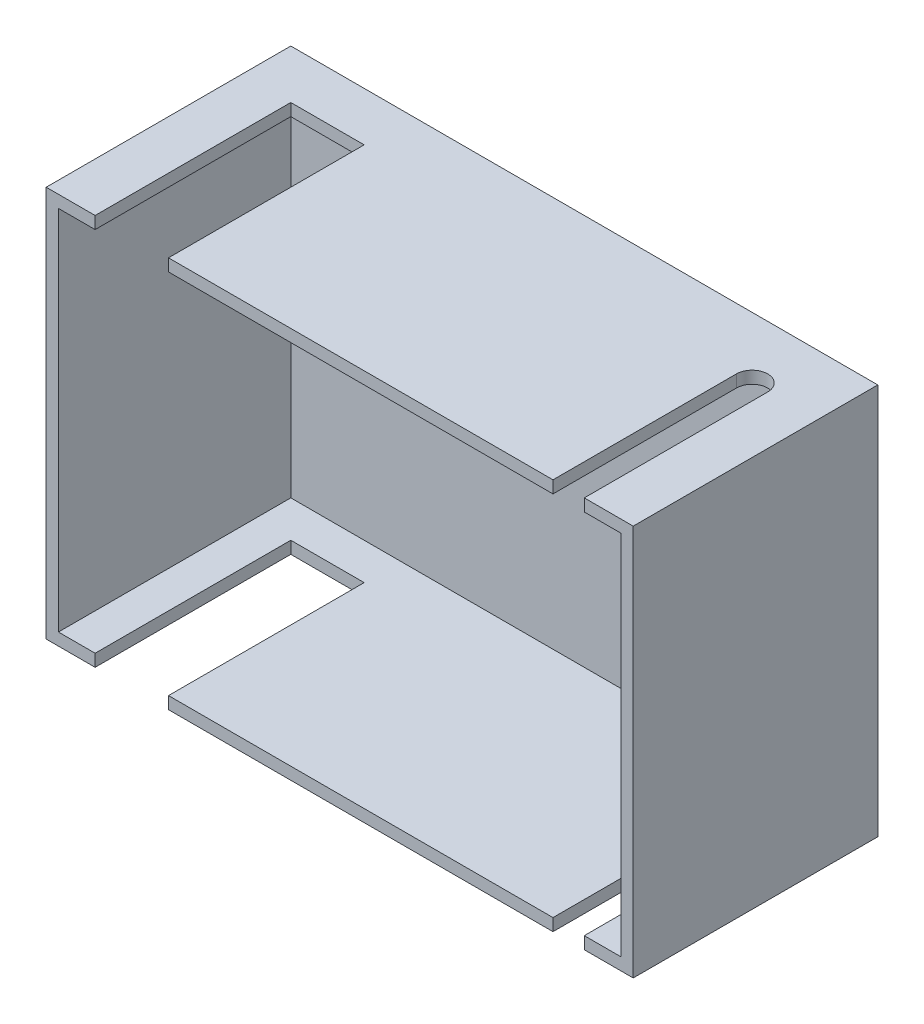
ISO-10303-21;
HEADER;
FILE_DESCRIPTION(('STEP AP214'),'2;1');
FILE_NAME('part.step','',(''),(''),'','','');
FILE_SCHEMA(('AUTOMOTIVE_DESIGN { 1 0 10303 214 1 1 1 1 }'));
ENDSEC;
DATA;
#1=APPLICATION_CONTEXT('core data for automotive mechanical design processes');
#2=APPLICATION_PROTOCOL_DEFINITION('international standard','automotive_design',2000,#1);
#3=PRODUCT_CONTEXT('',#1,'mechanical');
#4=PRODUCT('Part','Part','',(#3));
#5=PRODUCT_RELATED_PRODUCT_CATEGORY('part','',(#4));
#6=PRODUCT_DEFINITION_FORMATION('','',#4);
#7=PRODUCT_DEFINITION_CONTEXT('part definition',#1,'design');
#8=PRODUCT_DEFINITION('design','',#6,#7);
#9=PRODUCT_DEFINITION_SHAPE('','',#8);
#10=(LENGTH_UNIT() NAMED_UNIT(*) SI_UNIT(.MILLI.,.METRE.));
#11=(NAMED_UNIT(*) PLANE_ANGLE_UNIT() SI_UNIT($,.RADIAN.));
#12=(NAMED_UNIT(*) SI_UNIT($,.STERADIAN.) SOLID_ANGLE_UNIT());
#13=UNCERTAINTY_MEASURE_WITH_UNIT(LENGTH_MEASURE(1.E-05),#10,'distance_accuracy_value','');
#14=(GEOMETRIC_REPRESENTATION_CONTEXT(3) GLOBAL_UNCERTAINTY_ASSIGNED_CONTEXT((#13)) GLOBAL_UNIT_ASSIGNED_CONTEXT((#10,
#11,#12)) REPRESENTATION_CONTEXT('',''));
#15=CARTESIAN_POINT('',(0.,0.,0.));
#16=DIRECTION('',(0.,0.,1.));
#17=DIRECTION('',(1.,0.,0.));
#18=AXIS2_PLACEMENT_3D('',#15,#16,#17);
#19=CARTESIAN_POINT('',(0.,0.,50.));
#20=DIRECTION('',(0.,0.,1.));
#21=DIRECTION('',(1.,0.,0.));
#22=AXIS2_PLACEMENT_3D('',#19,#20,#21);
#23=PLANE('',#22);
#24=DIRECTION('',(1.,0.,0.));
#25=VECTOR('',#24,1.);
#26=CARTESIAN_POINT('',(-60.,-40.,50.));
#27=LINE('',#26,#25);
#28=CARTESIAN_POINT('',(-35.,-40.,50.));
#29=VERTEX_POINT('',#28);
#30=CARTESIAN_POINT('',(43.6,-40.,50.));
#31=VERTEX_POINT('',#30);
#32=EDGE_CURVE('E325',#29,#31,#27,.T.);
#33=ORIENTED_EDGE('',*,*,#32,.T.);
#34=DIRECTION('',(0.,1.,0.));
#35=VECTOR('',#34,1.);
#36=CARTESIAN_POINT('',(43.6,-230.804219030922,50.));
#37=LINE('',#36,#35);
#38=CARTESIAN_POINT('',(43.6,-37.5,50.));
#39=VERTEX_POINT('',#38);
#40=EDGE_CURVE('E222',#31,#39,#37,.T.);
#41=ORIENTED_EDGE('',*,*,#40,.T.);
#42=DIRECTION('',(1.,0.,0.));
#43=VECTOR('',#42,1.);
#44=CARTESIAN_POINT('',(-60.,-37.5,50.));
#45=LINE('',#44,#43);
#46=CARTESIAN_POINT('',(-35.,-37.5,50.));
#47=VERTEX_POINT('',#46);
#48=EDGE_CURVE('E309',#47,#39,#45,.T.);
#49=ORIENTED_EDGE('',*,*,#48,.F.);
#50=DIRECTION('',(0.,-1.,0.));
#51=VECTOR('',#50,1.);
#52=CARTESIAN_POINT('',(-35.,50.,50.));
#53=LINE('',#52,#51);
#54=EDGE_CURVE('E244',#47,#29,#53,.T.);
#55=ORIENTED_EDGE('',*,*,#54,.T.);
#56=EDGE_LOOP('',(#33,#41,#49,#55));
#57=FACE_BOUND('',#56,.T.);
#58=ADVANCED_FACE('F33',(#57),#23,.T.);
#59=DIRECTION('',(-1.,0.,0.));
#60=VECTOR('',#59,1.);
#61=CARTESIAN_POINT('',(-60.,37.5,50.));
#62=LINE('',#61,#60);
#63=CARTESIAN_POINT('',(43.6,37.5,50.));
#64=VERTEX_POINT('',#63);
#65=CARTESIAN_POINT('',(-35.,37.5,50.));
#66=VERTEX_POINT('',#65);
#67=EDGE_CURVE('E303',#64,#66,#62,.T.);
#68=ORIENTED_EDGE('',*,*,#67,.F.);
#69=CARTESIAN_POINT('',(43.6,40.,50.));
#70=VERTEX_POINT('',#69);
#71=EDGE_CURVE('E358',#64,#70,#37,.T.);
#72=ORIENTED_EDGE('',*,*,#71,.T.);
#73=DIRECTION('',(-1.,0.,0.));
#74=VECTOR('',#73,1.);
#75=CARTESIAN_POINT('',(-60.,40.,50.));
#76=LINE('',#75,#74);
#77=CARTESIAN_POINT('',(-35.,40.,50.));
#78=VERTEX_POINT('',#77);
#79=EDGE_CURVE('E319',#70,#78,#76,.T.);
#80=ORIENTED_EDGE('',*,*,#79,.T.);
#81=EDGE_CURVE('E254',#78,#66,#53,.T.);
#82=ORIENTED_EDGE('',*,*,#81,.T.);
#83=EDGE_LOOP('',(#68,#72,#80,#82));
#84=FACE_BOUND('',#83,.T.);
#85=ADVANCED_FACE('F402',(#84),#23,.T.);
#86=CARTESIAN_POINT('',(60.,40.,50.));
#87=VERTEX_POINT('',#86);
#88=CARTESIAN_POINT('',(50.,40.,50.));
#89=VERTEX_POINT('',#88);
#90=EDGE_CURVE('E315',#87,#89,#76,.T.);
#91=ORIENTED_EDGE('',*,*,#90,.T.);
#92=DIRECTION('',(0.,1.,0.));
#93=VECTOR('',#92,1.);
#94=CARTESIAN_POINT('',(50.,-230.804219030922,50.));
#95=LINE('',#94,#93);
#96=CARTESIAN_POINT('',(50.,37.5,50.));
#97=VERTEX_POINT('',#96);
#98=EDGE_CURVE('E211',#97,#89,#95,.T.);
#99=ORIENTED_EDGE('',*,*,#98,.F.);
#100=CARTESIAN_POINT('',(57.5,37.5,50.));
#101=VERTEX_POINT('',#100);
#102=EDGE_CURVE('E299',#101,#97,#62,.T.);
#103=ORIENTED_EDGE('',*,*,#102,.F.);
#104=DIRECTION('',(0.,1.,0.));
#105=VECTOR('',#104,1.);
#106=CARTESIAN_POINT('',(57.5,40.,50.));
#107=LINE('',#106,#105);
#108=CARTESIAN_POINT('',(57.5,-37.5,50.));
#109=VERTEX_POINT('',#108);
#110=EDGE_CURVE('E296',#109,#101,#107,.T.);
#111=ORIENTED_EDGE('',*,*,#110,.F.);
#112=CARTESIAN_POINT('',(50.,-37.5,50.));
#113=VERTEX_POINT('',#112);
#114=EDGE_CURVE('E306',#113,#109,#45,.T.);
#115=ORIENTED_EDGE('',*,*,#114,.F.);
#116=CARTESIAN_POINT('',(50.,-40.,50.));
#117=VERTEX_POINT('',#116);
#118=EDGE_CURVE('E56',#117,#113,#95,.T.);
#119=ORIENTED_EDGE('',*,*,#118,.F.);
#120=CARTESIAN_POINT('',(60.,-40.,50.));
#121=VERTEX_POINT('',#120);
#122=EDGE_CURVE('E216',#117,#121,#27,.T.);
#123=ORIENTED_EDGE('',*,*,#122,.T.);
#124=DIRECTION('',(0.,1.,0.));
#125=VECTOR('',#124,1.);
#126=CARTESIAN_POINT('',(60.,40.,50.));
#127=LINE('',#126,#125);
#128=EDGE_CURVE('E310',#121,#87,#127,.T.);
#129=ORIENTED_EDGE('',*,*,#128,.T.);
#130=EDGE_LOOP('',(#91,#99,#103,#111,#115,#119,#123,#129));
#131=FACE_BOUND('',#130,.T.);
#132=ADVANCED_FACE('F373',(#131),#23,.T.);
#133=CARTESIAN_POINT('',(-60.,40.,50.));
#134=DIRECTION('',(0.,-1.,0.));
#135=DIRECTION('',(0.,0.,-1.));
#136=AXIS2_PLACEMENT_3D('',#133,#134,#135);
#137=PLANE('',#136);
#138=DIRECTION('',(0.,0.,1.));
#139=VECTOR('',#138,1.);
#140=CARTESIAN_POINT('',(43.6,40.,50.));
#141=LINE('',#140,#139);
#142=CARTESIAN_POINT('',(43.6,40.,12.5));
#143=VERTEX_POINT('',#142);
#144=EDGE_CURVE('E234',#143,#70,#141,.T.);
#145=ORIENTED_EDGE('',*,*,#144,.F.);
#146=CARTESIAN_POINT('',(46.8,40.,12.5));
#147=DIRECTION('',(0.,-1.,0.));
#148=DIRECTION('',(0.,0.,-1.));
#149=AXIS2_PLACEMENT_3D('',#146,#147,#148);
#150=CIRCLE('',#149,3.2);
#151=CARTESIAN_POINT('',(50.,40.,12.5));
#152=VERTEX_POINT('',#151);
#153=EDGE_CURVE('E205',#152,#143,#150,.F.);
#154=ORIENTED_EDGE('',*,*,#153,.F.);
#155=DIRECTION('',(0.,0.,-1.));
#156=VECTOR('',#155,1.);
#157=CARTESIAN_POINT('',(50.,40.,50.));
#158=LINE('',#157,#156);
#159=EDGE_CURVE('E217',#89,#152,#158,.T.);
#160=ORIENTED_EDGE('',*,*,#159,.F.);
#161=ORIENTED_EDGE('',*,*,#90,.F.);
#162=DIRECTION('',(0.,0.,-1.));
#163=VECTOR('',#162,1.);
#164=CARTESIAN_POINT('',(60.,40.,50.));
#165=LINE('',#164,#163);
#166=CARTESIAN_POINT('',(60.,40.,0.));
#167=VERTEX_POINT('',#166);
#168=EDGE_CURVE('E341',#87,#167,#165,.T.);
#169=ORIENTED_EDGE('',*,*,#168,.T.);
#170=DIRECTION('',(-1.,0.,0.));
#171=VECTOR('',#170,1.);
#172=CARTESIAN_POINT('',(-60.,40.,0.));
#173=LINE('',#172,#171);
#174=CARTESIAN_POINT('',(-60.,40.,0.));
#175=VERTEX_POINT('',#174);
#176=EDGE_CURVE('E328',#167,#175,#173,.T.);
#177=ORIENTED_EDGE('',*,*,#176,.T.);
#178=DIRECTION('',(0.,0.,-1.));
#179=VECTOR('',#178,1.);
#180=CARTESIAN_POINT('',(-60.,40.,50.));
#181=LINE('',#180,#179);
#182=CARTESIAN_POINT('',(-60.,40.,50.));
#183=VERTEX_POINT('',#182);
#184=EDGE_CURVE('E338',#183,#175,#181,.T.);
#185=ORIENTED_EDGE('',*,*,#184,.F.);
#186=CARTESIAN_POINT('',(-50.,40.,50.));
#187=VERTEX_POINT('',#186);
#188=EDGE_CURVE('E313',#187,#183,#76,.T.);
#189=ORIENTED_EDGE('',*,*,#188,.F.);
#190=DIRECTION('',(0.,0.,-1.));
#191=VECTOR('',#190,1.);
#192=CARTESIAN_POINT('',(-50.,40.,50.));
#193=LINE('',#192,#191);
#194=CARTESIAN_POINT('',(-50.,40.,10.));
#195=VERTEX_POINT('',#194);
#196=EDGE_CURVE('E259',#187,#195,#193,.T.);
#197=ORIENTED_EDGE('',*,*,#196,.T.);
#198=DIRECTION('',(1.,0.,0.));
#199=VECTOR('',#198,1.);
#200=CARTESIAN_POINT('',(-60.,40.,10.));
#201=LINE('',#200,#199);
#202=CARTESIAN_POINT('',(-35.,40.,10.));
#203=VERTEX_POINT('',#202);
#204=EDGE_CURVE('E264',#195,#203,#201,.T.);
#205=ORIENTED_EDGE('',*,*,#204,.T.);
#206=DIRECTION('',(0.,0.,1.));
#207=VECTOR('',#206,1.);
#208=CARTESIAN_POINT('',(-35.,40.,50.));
#209=LINE('',#208,#207);
#210=EDGE_CURVE('E270',#203,#78,#209,.T.);
#211=ORIENTED_EDGE('',*,*,#210,.T.);
#212=ORIENTED_EDGE('',*,*,#79,.F.);
#213=EDGE_LOOP('',(#145,#154,#160,#161,#169,#177,#185,#189,#197,#205,#211,#212));
#214=FACE_BOUND('',#213,.T.);
#215=ADVANCED_FACE('F372',(#214),#137,.F.);
#216=CARTESIAN_POINT('',(-60.,-40.,50.));
#217=DIRECTION('',(0.,1.,0.));
#218=DIRECTION('',(0.,0.,1.));
#219=AXIS2_PLACEMENT_3D('',#216,#217,#218);
#220=PLANE('',#219);
#221=DIRECTION('',(0.,0.,-1.));
#222=VECTOR('',#221,1.);
#223=CARTESIAN_POINT('',(43.6,-40.,50.));
#224=LINE('',#223,#222);
#225=CARTESIAN_POINT('',(43.6,-40.,12.5));
#226=VERTEX_POINT('',#225);
#227=EDGE_CURVE('E232',#31,#226,#224,.T.);
#228=ORIENTED_EDGE('',*,*,#227,.F.);
#229=ORIENTED_EDGE('',*,*,#32,.F.);
#230=DIRECTION('',(0.,0.,1.));
#231=VECTOR('',#230,1.);
#232=CARTESIAN_POINT('',(-35.,-40.,50.));
#233=LINE('',#232,#231);
#234=CARTESIAN_POINT('',(-35.,-40.,10.));
#235=VERTEX_POINT('',#234);
#236=EDGE_CURVE('E236',#235,#29,#233,.T.);
#237=ORIENTED_EDGE('',*,*,#236,.F.);
#238=DIRECTION('',(1.,0.,0.));
#239=VECTOR('',#238,1.);
#240=CARTESIAN_POINT('',(-50.,-40.,10.));
#241=LINE('',#240,#239);
#242=CARTESIAN_POINT('',(-50.,-40.,10.));
#243=VERTEX_POINT('',#242);
#244=EDGE_CURVE('E241',#243,#235,#241,.T.);
#245=ORIENTED_EDGE('',*,*,#244,.F.);
#246=DIRECTION('',(0.,0.,-1.));
#247=VECTOR('',#246,1.);
#248=CARTESIAN_POINT('',(-50.,-40.,50.));
#249=LINE('',#248,#247);
#250=CARTESIAN_POINT('',(-50.,-40.,50.));
#251=VERTEX_POINT('',#250);
#252=EDGE_CURVE('E238',#251,#243,#249,.T.);
#253=ORIENTED_EDGE('',*,*,#252,.F.);
#254=CARTESIAN_POINT('',(-60.,-40.,50.));
#255=VERTEX_POINT('',#254);
#256=EDGE_CURVE('E321',#255,#251,#27,.T.);
#257=ORIENTED_EDGE('',*,*,#256,.F.);
#258=DIRECTION('',(0.,0.,-1.));
#259=VECTOR('',#258,1.);
#260=CARTESIAN_POINT('',(-60.,-40.,50.));
#261=LINE('',#260,#259);
#262=CARTESIAN_POINT('',(-60.,-40.,0.));
#263=VERTEX_POINT('',#262);
#264=EDGE_CURVE('E335',#255,#263,#261,.T.);
#265=ORIENTED_EDGE('',*,*,#264,.T.);
#266=DIRECTION('',(1.,0.,0.));
#267=VECTOR('',#266,1.);
#268=CARTESIAN_POINT('',(-60.,-40.,0.));
#269=LINE('',#268,#267);
#270=CARTESIAN_POINT('',(60.,-40.,0.));
#271=VERTEX_POINT('',#270);
#272=EDGE_CURVE('E314',#263,#271,#269,.T.);
#273=ORIENTED_EDGE('',*,*,#272,.T.);
#274=DIRECTION('',(0.,0.,-1.));
#275=VECTOR('',#274,1.);
#276=CARTESIAN_POINT('',(60.,-40.,50.));
#277=LINE('',#276,#275);
#278=EDGE_CURVE('E324',#121,#271,#277,.T.);
#279=ORIENTED_EDGE('',*,*,#278,.F.);
#280=ORIENTED_EDGE('',*,*,#122,.F.);
#281=DIRECTION('',(0.,0.,1.));
#282=VECTOR('',#281,1.);
#283=CARTESIAN_POINT('',(50.,-40.,50.));
#284=LINE('',#283,#282);
#285=CARTESIAN_POINT('',(50.,-40.,12.5));
#286=VERTEX_POINT('',#285);
#287=EDGE_CURVE('E209',#286,#117,#284,.T.);
#288=ORIENTED_EDGE('',*,*,#287,.F.);
#289=CARTESIAN_POINT('',(46.8,-40.,12.5));
#290=DIRECTION('',(0.,1.,0.));
#291=DIRECTION('',(0.,0.,1.));
#292=AXIS2_PLACEMENT_3D('',#289,#290,#291);
#293=CIRCLE('',#292,3.2);
#294=EDGE_CURVE('E195',#226,#286,#293,.F.);
#295=ORIENTED_EDGE('',*,*,#294,.F.);
#296=EDGE_LOOP('',(#228,#229,#237,#245,#253,#257,#265,#273,#279,#280,#288,#295));
#297=FACE_BOUND('',#296,.T.);
#298=ADVANCED_FACE('F214',(#297),#220,.F.);
#299=CARTESIAN_POINT('',(-60.,37.5,50.));
#300=DIRECTION('',(0.,-1.,0.));
#301=DIRECTION('',(0.,0.,-1.));
#302=AXIS2_PLACEMENT_3D('',#299,#300,#301);
#303=PLANE('',#302);
#304=CARTESIAN_POINT('',(46.8,37.5,12.5));
#305=DIRECTION('',(0.,-1.,0.));
#306=DIRECTION('',(0.,0.,-1.));
#307=AXIS2_PLACEMENT_3D('',#304,#305,#306);
#308=CIRCLE('',#307,3.2);
#309=CARTESIAN_POINT('',(50.,37.5,12.5));
#310=VERTEX_POINT('',#309);
#311=CARTESIAN_POINT('',(43.6,37.5,12.5));
#312=VERTEX_POINT('',#311);
#313=EDGE_CURVE('E206',#310,#312,#308,.F.);
#314=ORIENTED_EDGE('',*,*,#313,.T.);
#315=DIRECTION('',(0.,0.,1.));
#316=VECTOR('',#315,1.);
#317=CARTESIAN_POINT('',(43.6,37.5,50.));
#318=LINE('',#317,#316);
#319=EDGE_CURVE('E229',#312,#64,#318,.T.);
#320=ORIENTED_EDGE('',*,*,#319,.T.);
#321=ORIENTED_EDGE('',*,*,#67,.T.);
#322=DIRECTION('',(0.,0.,1.));
#323=VECTOR('',#322,1.);
#324=CARTESIAN_POINT('',(-35.,37.5,50.));
#325=LINE('',#324,#323);
#326=CARTESIAN_POINT('',(-35.,37.5,10.));
#327=VERTEX_POINT('',#326);
#328=EDGE_CURVE('E267',#327,#66,#325,.T.);
#329=ORIENTED_EDGE('',*,*,#328,.F.);
#330=DIRECTION('',(1.,0.,0.));
#331=VECTOR('',#330,1.);
#332=CARTESIAN_POINT('',(-60.,37.5,10.));
#333=LINE('',#332,#331);
#334=CARTESIAN_POINT('',(-50.,37.5,10.));
#335=VERTEX_POINT('',#334);
#336=EDGE_CURVE('E262',#335,#327,#333,.T.);
#337=ORIENTED_EDGE('',*,*,#336,.F.);
#338=DIRECTION('',(0.,0.,-1.));
#339=VECTOR('',#338,1.);
#340=CARTESIAN_POINT('',(-50.,37.5,50.));
#341=LINE('',#340,#339);
#342=CARTESIAN_POINT('',(-50.,37.5,50.));
#343=VERTEX_POINT('',#342);
#344=EDGE_CURVE('E257',#343,#335,#341,.T.);
#345=ORIENTED_EDGE('',*,*,#344,.F.);
#346=CARTESIAN_POINT('',(-57.5,37.5,50.));
#347=VERTEX_POINT('',#346);
#348=EDGE_CURVE('E298',#343,#347,#62,.T.);
#349=ORIENTED_EDGE('',*,*,#348,.T.);
#350=DIRECTION('',(0.,0.,-1.));
#351=VECTOR('',#350,1.);
#352=CARTESIAN_POINT('',(-57.5,37.5,50.));
#353=LINE('',#352,#351);
#354=CARTESIAN_POINT('',(-57.5,37.5,2.5));
#355=VERTEX_POINT('',#354);
#356=EDGE_CURVE('E281',#347,#355,#353,.T.);
#357=ORIENTED_EDGE('',*,*,#356,.T.);
#358=DIRECTION('',(-1.,0.,0.));
#359=VECTOR('',#358,1.);
#360=CARTESIAN_POINT('',(-60.,37.5,2.5));
#361=LINE('',#360,#359);
#362=CARTESIAN_POINT('',(57.5,37.5,2.5));
#363=VERTEX_POINT('',#362);
#364=EDGE_CURVE('E276',#363,#355,#361,.T.);
#365=ORIENTED_EDGE('',*,*,#364,.F.);
#366=DIRECTION('',(0.,0.,-1.));
#367=VECTOR('',#366,1.);
#368=CARTESIAN_POINT('',(57.5,37.5,50.));
#369=LINE('',#368,#367);
#370=EDGE_CURVE('E277',#101,#363,#369,.T.);
#371=ORIENTED_EDGE('',*,*,#370,.F.);
#372=ORIENTED_EDGE('',*,*,#102,.T.);
#373=DIRECTION('',(0.,0.,-1.));
#374=VECTOR('',#373,1.);
#375=CARTESIAN_POINT('',(50.,37.5,50.));
#376=LINE('',#375,#374);
#377=EDGE_CURVE('E218',#97,#310,#376,.T.);
#378=ORIENTED_EDGE('',*,*,#377,.T.);
#379=EDGE_LOOP('',(#314,#320,#321,#329,#337,#345,#349,#357,#365,#371,#372,#378));
#380=FACE_BOUND('',#379,.T.);
#381=ADVANCED_FACE('F417',(#380),#303,.T.);
#382=CARTESIAN_POINT('',(-60.,-37.5,50.));
#383=DIRECTION('',(0.,1.,0.));
#384=DIRECTION('',(0.,0.,1.));
#385=AXIS2_PLACEMENT_3D('',#382,#383,#384);
#386=PLANE('',#385);
#387=ORIENTED_EDGE('',*,*,#48,.T.);
#388=DIRECTION('',(0.,0.,-1.));
#389=VECTOR('',#388,1.);
#390=CARTESIAN_POINT('',(43.6,-37.5,50.));
#391=LINE('',#390,#389);
#392=CARTESIAN_POINT('',(43.6,-37.5,12.5));
#393=VERTEX_POINT('',#392);
#394=EDGE_CURVE('E11',#39,#393,#391,.T.);
#395=ORIENTED_EDGE('',*,*,#394,.T.);
#396=CARTESIAN_POINT('',(46.8,-37.5,12.5));
#397=DIRECTION('',(0.,1.,0.));
#398=DIRECTION('',(0.,0.,1.));
#399=AXIS2_PLACEMENT_3D('',#396,#397,#398);
#400=CIRCLE('',#399,3.2);
#401=CARTESIAN_POINT('',(50.,-37.5,12.5));
#402=VERTEX_POINT('',#401);
#403=EDGE_CURVE('E41',#393,#402,#400,.F.);
#404=ORIENTED_EDGE('',*,*,#403,.T.);
#405=DIRECTION('',(0.,0.,1.));
#406=VECTOR('',#405,1.);
#407=CARTESIAN_POINT('',(50.,-37.5,50.));
#408=LINE('',#407,#406);
#409=EDGE_CURVE('E210',#402,#113,#408,.T.);
#410=ORIENTED_EDGE('',*,*,#409,.T.);
#411=ORIENTED_EDGE('',*,*,#114,.T.);
#412=DIRECTION('',(0.,0.,-1.));
#413=VECTOR('',#412,1.);
#414=CARTESIAN_POINT('',(57.5,-37.5,50.));
#415=LINE('',#414,#413);
#416=CARTESIAN_POINT('',(57.5,-37.5,2.5));
#417=VERTEX_POINT('',#416);
#418=EDGE_CURVE('E282',#109,#417,#415,.T.);
#419=ORIENTED_EDGE('',*,*,#418,.T.);
#420=DIRECTION('',(1.,0.,0.));
#421=VECTOR('',#420,1.);
#422=CARTESIAN_POINT('',(-60.,-37.5,2.5));
#423=LINE('',#422,#421);
#424=CARTESIAN_POINT('',(-57.5,-37.5,2.5));
#425=VERTEX_POINT('',#424);
#426=EDGE_CURVE('E292',#425,#417,#423,.T.);
#427=ORIENTED_EDGE('',*,*,#426,.F.);
#428=DIRECTION('',(0.,0.,-1.));
#429=VECTOR('',#428,1.);
#430=CARTESIAN_POINT('',(-57.5,-37.5,50.));
#431=LINE('',#430,#429);
#432=CARTESIAN_POINT('',(-57.5,-37.5,50.));
#433=VERTEX_POINT('',#432);
#434=EDGE_CURVE('E285',#433,#425,#431,.T.);
#435=ORIENTED_EDGE('',*,*,#434,.F.);
#436=CARTESIAN_POINT('',(-50.,-37.5,50.));
#437=VERTEX_POINT('',#436);
#438=EDGE_CURVE('E286',#433,#437,#45,.T.);
#439=ORIENTED_EDGE('',*,*,#438,.T.);
#440=DIRECTION('',(0.,0.,1.));
#441=VECTOR('',#440,1.);
#442=CARTESIAN_POINT('',(-50.,-37.5,50.));
#443=LINE('',#442,#441);
#444=CARTESIAN_POINT('',(-50.,-37.5,10.));
#445=VERTEX_POINT('',#444);
#446=EDGE_CURVE('E344',#445,#437,#443,.T.);
#447=ORIENTED_EDGE('',*,*,#446,.F.);
#448=DIRECTION('',(-1.,0.,0.));
#449=VECTOR('',#448,1.);
#450=CARTESIAN_POINT('',(-60.,-37.5,10.));
#451=LINE('',#450,#449);
#452=CARTESIAN_POINT('',(-35.,-37.5,10.));
#453=VERTEX_POINT('',#452);
#454=EDGE_CURVE('E346',#453,#445,#451,.T.);
#455=ORIENTED_EDGE('',*,*,#454,.F.);
#456=DIRECTION('',(0.,0.,-1.));
#457=VECTOR('',#456,1.);
#458=CARTESIAN_POINT('',(-35.,-37.5,50.));
#459=LINE('',#458,#457);
#460=EDGE_CURVE('E349',#47,#453,#459,.T.);
#461=ORIENTED_EDGE('',*,*,#460,.F.);
#462=EDGE_LOOP('',(#387,#395,#404,#410,#411,#419,#427,#435,#439,#447,#455,#461));
#463=FACE_BOUND('',#462,.T.);
#464=ADVANCED_FACE('F353',(#463),#386,.T.);
#465=CARTESIAN_POINT('',(60.,40.,50.));
#466=DIRECTION('',(-1.,0.,0.));
#467=DIRECTION('',(0.,0.,1.));
#468=AXIS2_PLACEMENT_3D('',#465,#466,#467);
#469=PLANE('',#468);
#470=DIRECTION('',(0.,1.,0.));
#471=VECTOR('',#470,1.);
#472=CARTESIAN_POINT('',(60.,40.,0.));
#473=LINE('',#472,#471);
#474=EDGE_CURVE('E280',#271,#167,#473,.T.);
#475=ORIENTED_EDGE('',*,*,#474,.T.);
#476=ORIENTED_EDGE('',*,*,#168,.F.);
#477=ORIENTED_EDGE('',*,*,#128,.F.);
#478=ORIENTED_EDGE('',*,*,#278,.T.);
#479=EDGE_LOOP('',(#475,#476,#477,#478));
#480=FACE_BOUND('',#479,.T.);
#481=ADVANCED_FACE('F35',(#480),#469,.F.);
#482=CARTESIAN_POINT('',(-60.,40.,50.));
#483=DIRECTION('',(1.,0.,0.));
#484=DIRECTION('',(0.,1.,0.));
#485=AXIS2_PLACEMENT_3D('',#482,#483,#484);
#486=PLANE('',#485);
#487=DIRECTION('',(0.,-1.,0.));
#488=VECTOR('',#487,1.);
#489=CARTESIAN_POINT('',(-60.,40.,0.));
#490=LINE('',#489,#488);
#491=EDGE_CURVE('E330',#175,#263,#490,.T.);
#492=ORIENTED_EDGE('',*,*,#491,.T.);
#493=ORIENTED_EDGE('',*,*,#264,.F.);
#494=DIRECTION('',(0.,-1.,0.));
#495=VECTOR('',#494,1.);
#496=CARTESIAN_POINT('',(-60.,40.,50.));
#497=LINE('',#496,#495);
#498=EDGE_CURVE('E318',#183,#255,#497,.T.);
#499=ORIENTED_EDGE('',*,*,#498,.F.);
#500=ORIENTED_EDGE('',*,*,#184,.T.);
#501=EDGE_LOOP('',(#492,#493,#499,#500));
#502=FACE_BOUND('',#501,.T.);
#503=ADVANCED_FACE('F384',(#502),#486,.F.);
#504=DIRECTION('',(0.,-1.,0.));
#505=VECTOR('',#504,1.);
#506=CARTESIAN_POINT('',(-50.,50.,50.));
#507=LINE('',#506,#505);
#508=EDGE_CURVE('E251',#187,#343,#507,.T.);
#509=ORIENTED_EDGE('',*,*,#508,.F.);
#510=ORIENTED_EDGE('',*,*,#188,.T.);
#511=ORIENTED_EDGE('',*,*,#498,.T.);
#512=ORIENTED_EDGE('',*,*,#256,.T.);
#513=EDGE_CURVE('E252',#437,#251,#507,.T.);
#514=ORIENTED_EDGE('',*,*,#513,.F.);
#515=ORIENTED_EDGE('',*,*,#438,.F.);
#516=DIRECTION('',(0.,-1.,0.));
#517=VECTOR('',#516,1.);
#518=CARTESIAN_POINT('',(-57.5,40.,50.));
#519=LINE('',#518,#517);
#520=EDGE_CURVE('E302',#347,#433,#519,.T.);
#521=ORIENTED_EDGE('',*,*,#520,.F.);
#522=ORIENTED_EDGE('',*,*,#348,.F.);
#523=EDGE_LOOP('',(#509,#510,#511,#512,#514,#515,#521,#522));
#524=FACE_BOUND('',#523,.T.);
#525=ADVANCED_FACE('F394',(#524),#23,.T.);
#526=CARTESIAN_POINT('',(0.,0.,0.));
#527=DIRECTION('',(0.,0.,1.));
#528=DIRECTION('',(1.,0.,0.));
#529=AXIS2_PLACEMENT_3D('',#526,#527,#528);
#530=PLANE('',#529);
#531=ORIENTED_EDGE('',*,*,#474,.F.);
#532=ORIENTED_EDGE('',*,*,#272,.F.);
#533=ORIENTED_EDGE('',*,*,#491,.F.);
#534=ORIENTED_EDGE('',*,*,#176,.F.);
#535=EDGE_LOOP('',(#531,#532,#533,#534));
#536=FACE_BOUND('',#535,.T.);
#537=ADVANCED_FACE('F387',(#536),#530,.F.);
#538=CARTESIAN_POINT('',(57.5,40.,50.));
#539=DIRECTION('',(-1.,0.,0.));
#540=DIRECTION('',(0.,0.,1.));
#541=AXIS2_PLACEMENT_3D('',#538,#539,#540);
#542=PLANE('',#541);
#543=DIRECTION('',(0.,1.,0.));
#544=VECTOR('',#543,1.);
#545=CARTESIAN_POINT('',(57.5,40.,2.5));
#546=LINE('',#545,#544);
#547=EDGE_CURVE('E273',#417,#363,#546,.T.);
#548=ORIENTED_EDGE('',*,*,#547,.F.);
#549=ORIENTED_EDGE('',*,*,#418,.F.);
#550=ORIENTED_EDGE('',*,*,#110,.T.);
#551=ORIENTED_EDGE('',*,*,#370,.T.);
#552=EDGE_LOOP('',(#548,#549,#550,#551));
#553=FACE_BOUND('',#552,.T.);
#554=ADVANCED_FACE('F430',(#553),#542,.T.);
#555=CARTESIAN_POINT('',(-57.5,40.,50.));
#556=DIRECTION('',(1.,0.,0.));
#557=DIRECTION('',(0.,1.,0.));
#558=AXIS2_PLACEMENT_3D('',#555,#556,#557);
#559=PLANE('',#558);
#560=DIRECTION('',(0.,-1.,0.));
#561=VECTOR('',#560,1.);
#562=CARTESIAN_POINT('',(-57.5,40.,2.5));
#563=LINE('',#562,#561);
#564=EDGE_CURVE('E288',#355,#425,#563,.T.);
#565=ORIENTED_EDGE('',*,*,#564,.F.);
#566=ORIENTED_EDGE('',*,*,#356,.F.);
#567=ORIENTED_EDGE('',*,*,#520,.T.);
#568=ORIENTED_EDGE('',*,*,#434,.T.);
#569=EDGE_LOOP('',(#565,#566,#567,#568));
#570=FACE_BOUND('',#569,.T.);
#571=ADVANCED_FACE('F449',(#570),#559,.T.);
#572=CARTESIAN_POINT('',(0.,0.,2.5));
#573=DIRECTION('',(0.,0.,1.));
#574=DIRECTION('',(1.,0.,0.));
#575=AXIS2_PLACEMENT_3D('',#572,#573,#574);
#576=PLANE('',#575);
#577=ORIENTED_EDGE('',*,*,#547,.T.);
#578=ORIENTED_EDGE('',*,*,#364,.T.);
#579=ORIENTED_EDGE('',*,*,#564,.T.);
#580=ORIENTED_EDGE('',*,*,#426,.T.);
#581=EDGE_LOOP('',(#577,#578,#579,#580));
#582=FACE_BOUND('',#581,.T.);
#583=ADVANCED_FACE('F451',(#582),#576,.T.);
#584=CARTESIAN_POINT('',(-50.,50.,50.));
#585=DIRECTION('',(-1.,0.,0.));
#586=DIRECTION('',(0.,0.,1.));
#587=AXIS2_PLACEMENT_3D('',#584,#585,#586);
#588=PLANE('',#587);
#589=ORIENTED_EDGE('',*,*,#446,.T.);
#590=ORIENTED_EDGE('',*,*,#513,.T.);
#591=ORIENTED_EDGE('',*,*,#252,.T.);
#592=DIRECTION('',(0.,-1.,0.));
#593=VECTOR('',#592,1.);
#594=CARTESIAN_POINT('',(-50.,50.,10.));
#595=LINE('',#594,#593);
#596=EDGE_CURVE('E249',#445,#243,#595,.T.);
#597=ORIENTED_EDGE('',*,*,#596,.F.);
#598=EDGE_LOOP('',(#589,#590,#591,#597));
#599=FACE_BOUND('',#598,.T.);
#600=ADVANCED_FACE('F446',(#599),#588,.F.);
#601=CARTESIAN_POINT('',(-50.,50.,10.));
#602=DIRECTION('',(0.,0.,-1.));
#603=DIRECTION('',(-1.,0.,0.));
#604=AXIS2_PLACEMENT_3D('',#601,#602,#603);
#605=PLANE('',#604);
#606=ORIENTED_EDGE('',*,*,#454,.T.);
#607=ORIENTED_EDGE('',*,*,#596,.T.);
#608=ORIENTED_EDGE('',*,*,#244,.T.);
#609=DIRECTION('',(0.,-1.,0.));
#610=VECTOR('',#609,1.);
#611=CARTESIAN_POINT('',(-35.,50.,10.));
#612=LINE('',#611,#610);
#613=EDGE_CURVE('E245',#453,#235,#612,.T.);
#614=ORIENTED_EDGE('',*,*,#613,.F.);
#615=EDGE_LOOP('',(#606,#607,#608,#614));
#616=FACE_BOUND('',#615,.T.);
#617=ADVANCED_FACE('F443',(#616),#605,.F.);
#618=CARTESIAN_POINT('',(-35.,50.,50.));
#619=DIRECTION('',(1.,0.,0.));
#620=DIRECTION('',(0.,0.,-1.));
#621=AXIS2_PLACEMENT_3D('',#618,#619,#620);
#622=PLANE('',#621);
#623=ORIENTED_EDGE('',*,*,#460,.T.);
#624=ORIENTED_EDGE('',*,*,#613,.T.);
#625=ORIENTED_EDGE('',*,*,#236,.T.);
#626=ORIENTED_EDGE('',*,*,#54,.F.);
#627=EDGE_LOOP('',(#623,#624,#625,#626));
#628=FACE_BOUND('',#627,.T.);
#629=ADVANCED_FACE('F440',(#628),#622,.F.);
#630=EDGE_CURVE('E247',#203,#327,#612,.T.);
#631=ORIENTED_EDGE('',*,*,#630,.T.);
#632=ORIENTED_EDGE('',*,*,#328,.T.);
#633=ORIENTED_EDGE('',*,*,#81,.F.);
#634=ORIENTED_EDGE('',*,*,#210,.F.);
#635=EDGE_LOOP('',(#631,#632,#633,#634));
#636=FACE_BOUND('',#635,.T.);
#637=ADVANCED_FACE('F405',(#636),#622,.F.);
#638=EDGE_CURVE('E248',#195,#335,#595,.T.);
#639=ORIENTED_EDGE('',*,*,#638,.T.);
#640=ORIENTED_EDGE('',*,*,#336,.T.);
#641=ORIENTED_EDGE('',*,*,#630,.F.);
#642=ORIENTED_EDGE('',*,*,#204,.F.);
#643=EDGE_LOOP('',(#639,#640,#641,#642));
#644=FACE_BOUND('',#643,.T.);
#645=ADVANCED_FACE('F411',(#644),#605,.F.);
#646=ORIENTED_EDGE('',*,*,#508,.T.);
#647=ORIENTED_EDGE('',*,*,#344,.T.);
#648=ORIENTED_EDGE('',*,*,#638,.F.);
#649=ORIENTED_EDGE('',*,*,#196,.F.);
#650=EDGE_LOOP('',(#646,#647,#648,#649));
#651=FACE_BOUND('',#650,.T.);
#652=ADVANCED_FACE('F414',(#651),#588,.F.);
#653=CARTESIAN_POINT('',(50.,-230.804219030922,12.5));
#654=DIRECTION('',(-1.,0.,0.));
#655=DIRECTION('',(0.,0.,1.));
#656=AXIS2_PLACEMENT_3D('',#653,#654,#655);
#657=PLANE('',#656);
#658=DIRECTION('',(0.,1.,0.));
#659=VECTOR('',#658,1.);
#660=CARTESIAN_POINT('',(50.,-230.804219030922,12.5));
#661=LINE('',#660,#659);
#662=EDGE_CURVE('E198',#286,#402,#661,.T.);
#663=ORIENTED_EDGE('',*,*,#662,.F.);
#664=ORIENTED_EDGE('',*,*,#287,.T.);
#665=ORIENTED_EDGE('',*,*,#118,.T.);
#666=ORIENTED_EDGE('',*,*,#409,.F.);
#667=EDGE_LOOP('',(#663,#664,#665,#666));
#668=FACE_BOUND('',#667,.T.);
#669=ADVANCED_FACE('F208',(#668),#657,.T.);
#670=CARTESIAN_POINT('',(46.8,-230.804219030922,12.5));
#671=DIRECTION('',(0.,1.,0.));
#672=DIRECTION('',(0.,0.,1.));
#673=AXIS2_PLACEMENT_3D('',#670,#671,#672);
#674=CYLINDRICAL_SURFACE('',#673,3.2);
#675=DIRECTION('',(0.,1.,0.));
#676=VECTOR('',#675,1.);
#677=CARTESIAN_POINT('',(43.6,-230.804219030922,12.5));
#678=LINE('',#677,#676);
#679=EDGE_CURVE('E201',#226,#393,#678,.T.);
#680=ORIENTED_EDGE('',*,*,#679,.F.);
#681=ORIENTED_EDGE('',*,*,#294,.T.);
#682=ORIENTED_EDGE('',*,*,#662,.T.);
#683=ORIENTED_EDGE('',*,*,#403,.F.);
#684=EDGE_LOOP('',(#680,#681,#682,#683));
#685=FACE_BOUND('',#684,.T.);
#686=ADVANCED_FACE('F197',(#685),#674,.F.);
#687=CARTESIAN_POINT('',(43.6,-230.804219030922,12.5));
#688=DIRECTION('',(1.,0.,0.));
#689=DIRECTION('',(0.,0.,-1.));
#690=AXIS2_PLACEMENT_3D('',#687,#688,#689);
#691=PLANE('',#690);
#692=ORIENTED_EDGE('',*,*,#40,.F.);
#693=ORIENTED_EDGE('',*,*,#227,.T.);
#694=ORIENTED_EDGE('',*,*,#679,.T.);
#695=ORIENTED_EDGE('',*,*,#394,.F.);
#696=EDGE_LOOP('',(#692,#693,#694,#695));
#697=FACE_BOUND('',#696,.T.);
#698=ADVANCED_FACE('F356',(#697),#691,.T.);
#699=EDGE_CURVE('E359',#312,#143,#678,.T.);
#700=ORIENTED_EDGE('',*,*,#699,.T.);
#701=ORIENTED_EDGE('',*,*,#144,.T.);
#702=ORIENTED_EDGE('',*,*,#71,.F.);
#703=ORIENTED_EDGE('',*,*,#319,.F.);
#704=EDGE_LOOP('',(#700,#701,#702,#703));
#705=FACE_BOUND('',#704,.T.);
#706=ADVANCED_FACE('F422',(#705),#691,.T.);
#707=EDGE_CURVE('E48',#310,#152,#661,.T.);
#708=ORIENTED_EDGE('',*,*,#707,.T.);
#709=ORIENTED_EDGE('',*,*,#153,.T.);
#710=ORIENTED_EDGE('',*,*,#699,.F.);
#711=ORIENTED_EDGE('',*,*,#313,.F.);
#712=EDGE_LOOP('',(#708,#709,#710,#711));
#713=FACE_BOUND('',#712,.T.);
#714=ADVANCED_FACE('F424',(#713),#674,.F.);
#715=ORIENTED_EDGE('',*,*,#98,.T.);
#716=ORIENTED_EDGE('',*,*,#159,.T.);
#717=ORIENTED_EDGE('',*,*,#707,.F.);
#718=ORIENTED_EDGE('',*,*,#377,.F.);
#719=EDGE_LOOP('',(#715,#716,#717,#718));
#720=FACE_BOUND('',#719,.T.);
#721=ADVANCED_FACE('F366',(#720),#657,.T.);
#722=CLOSED_SHELL('',(#58,#85,#132,#215,#298,#381,#464,#481,#503,#525,#537,#554,#571,#583,#600,
#617,#629,#637,#645,#652,#669,#686,#698,#706,#714,#721));
#723=MANIFOLD_SOLID_BREP('B2',#722);
#724=ADVANCED_BREP_SHAPE_REPRESENTATION('',(#18,#723),#14);
#725=SHAPE_DEFINITION_REPRESENTATION(#9,#724);
ENDSEC;
END-ISO-10303-21;
